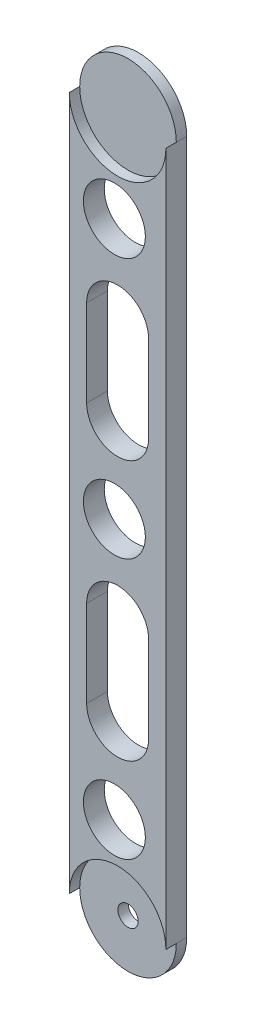
ISO-10303-21;
HEADER;
FILE_DESCRIPTION(('STEP AP214'),'2;1');
FILE_NAME('part.step','',(''),(''),'','','');
FILE_SCHEMA(('AUTOMOTIVE_DESIGN { 1 0 10303 214 1 1 1 1 }'));
ENDSEC;
DATA;
#1=APPLICATION_CONTEXT('core data for automotive mechanical design processes');
#2=APPLICATION_PROTOCOL_DEFINITION('international standard','automotive_design',2000,#1);
#3=PRODUCT_CONTEXT('',#1,'mechanical');
#4=PRODUCT('Part','Part','',(#3));
#5=PRODUCT_RELATED_PRODUCT_CATEGORY('part','',(#4));
#6=PRODUCT_DEFINITION_FORMATION('','',#4);
#7=PRODUCT_DEFINITION_CONTEXT('part definition',#1,'design');
#8=PRODUCT_DEFINITION('design','',#6,#7);
#9=PRODUCT_DEFINITION_SHAPE('','',#8);
#10=(LENGTH_UNIT() NAMED_UNIT(*) SI_UNIT(.MILLI.,.METRE.));
#11=(NAMED_UNIT(*) PLANE_ANGLE_UNIT() SI_UNIT($,.RADIAN.));
#12=(NAMED_UNIT(*) SI_UNIT($,.STERADIAN.) SOLID_ANGLE_UNIT());
#13=UNCERTAINTY_MEASURE_WITH_UNIT(LENGTH_MEASURE(1.E-05),#10,'distance_accuracy_value','');
#14=(GEOMETRIC_REPRESENTATION_CONTEXT(3) GLOBAL_UNCERTAINTY_ASSIGNED_CONTEXT((#13)) GLOBAL_UNIT_ASSIGNED_CONTEXT((#10,
#11,#12)) REPRESENTATION_CONTEXT('',''));
#15=CARTESIAN_POINT('',(0.,0.,0.));
#16=DIRECTION('',(0.,0.,1.));
#17=DIRECTION('',(1.,0.,0.));
#18=AXIS2_PLACEMENT_3D('',#15,#16,#17);
#19=CARTESIAN_POINT('',(0.,0.,6.));
#20=DIRECTION('',(0.,0.,1.));
#21=DIRECTION('',(1.,0.,0.));
#22=AXIS2_PLACEMENT_3D('',#19,#20,#21);
#23=PLANE('',#22);
#24=CARTESIAN_POINT('',(3.04057135861746,-147.813095238095,6.));
#25=DIRECTION('',(0.,0.,1.));
#26=DIRECTION('',(1.,0.,0.));
#27=AXIS2_PLACEMENT_3D('',#24,#25,#26);
#28=CIRCLE('',#27,8.925);
#29=CARTESIAN_POINT('',(11.9655713586175,-147.813095238095,6.));
#30=VERTEX_POINT('',#29);
#31=EDGE_CURVE('E505',#30,#30,#28,.T.);
#32=ORIENTED_EDGE('',*,*,#31,.F.);
#33=EDGE_LOOP('',(#32));
#34=FACE_BOUND('',#33,.T.);
#35=CARTESIAN_POINT('',(3.9664527218137,-122.813095238095,6.));
#36=DIRECTION('',(0.,0.,1.));
#37=DIRECTION('',(1.,0.,0.));
#38=AXIS2_PLACEMENT_3D('',#35,#36,#37);
#39=CIRCLE('',#38,8.925);
#40=CARTESIAN_POINT('',(12.8914527218137,-122.813095238095,6.));
#41=VERTEX_POINT('',#40);
#42=CARTESIAN_POINT('',(-4.9585472781863,-122.813095238095,6.));
#43=VERTEX_POINT('',#42);
#44=EDGE_CURVE('E166',#41,#43,#39,.F.);
#45=ORIENTED_EDGE('',*,*,#44,.T.);
#46=DIRECTION('',(0.,1.,0.));
#47=VECTOR('',#46,1.);
#48=CARTESIAN_POINT('',(-4.95854727818629,0.,6.));
#49=LINE('',#48,#47);
#50=CARTESIAN_POINT('',(-4.9585472781863,-97.8130952380952,6.));
#51=VERTEX_POINT('',#50);
#52=EDGE_CURVE('E169',#43,#51,#49,.T.);
#53=ORIENTED_EDGE('',*,*,#52,.T.);
#54=CARTESIAN_POINT('',(3.9664527218137,-97.8130952380952,6.));
#55=DIRECTION('',(0.,0.,1.));
#56=DIRECTION('',(1.,0.,0.));
#57=AXIS2_PLACEMENT_3D('',#54,#55,#56);
#58=CIRCLE('',#57,8.925);
#59=CARTESIAN_POINT('',(12.8914527218137,-97.8130952380952,6.));
#60=VERTEX_POINT('',#59);
#61=EDGE_CURVE('E161',#51,#60,#58,.F.);
#62=ORIENTED_EDGE('',*,*,#61,.T.);
#63=DIRECTION('',(0.,1.,0.));
#64=VECTOR('',#63,1.);
#65=CARTESIAN_POINT('',(12.8914527218137,0.,6.));
#66=LINE('',#65,#64);
#67=EDGE_CURVE('E141',#41,#60,#66,.T.);
#68=ORIENTED_EDGE('',*,*,#67,.F.);
#69=EDGE_LOOP('',(#45,#53,#62,#68));
#70=FACE_BOUND('',#69,.T.);
#71=CARTESIAN_POINT('',(3.04057135861746,-72.8130952380952,6.));
#72=DIRECTION('',(0.,0.,1.));
#73=DIRECTION('',(1.,0.,0.));
#74=AXIS2_PLACEMENT_3D('',#71,#72,#73);
#75=CIRCLE('',#74,8.925);
#76=CARTESIAN_POINT('',(11.9655713586175,-72.8130952380952,6.));
#77=VERTEX_POINT('',#76);
#78=EDGE_CURVE('E175',#77,#77,#75,.T.);
#79=ORIENTED_EDGE('',*,*,#78,.F.);
#80=EDGE_LOOP('',(#79));
#81=FACE_BOUND('',#80,.T.);
#82=CARTESIAN_POINT('',(3.04057135861746,2.1869047619048,6.));
#83=DIRECTION('',(0.,0.,1.));
#84=DIRECTION('',(1.,0.,0.));
#85=AXIS2_PLACEMENT_3D('',#82,#83,#84);
#86=CIRCLE('',#85,8.925);
#87=CARTESIAN_POINT('',(11.9655713586175,2.1869047619048,6.));
#88=VERTEX_POINT('',#87);
#89=EDGE_CURVE('E213',#88,#88,#86,.T.);
#90=ORIENTED_EDGE('',*,*,#89,.F.);
#91=EDGE_LOOP('',(#90));
#92=FACE_BOUND('',#91,.T.);
#93=CARTESIAN_POINT('',(3.9664527218137,27.1869047619048,6.));
#94=DIRECTION('',(0.,0.,1.));
#95=DIRECTION('',(1.,0.,0.));
#96=AXIS2_PLACEMENT_3D('',#93,#94,#95);
#97=CIRCLE('',#96,13.925);
#98=CARTESIAN_POINT('',(-9.9585472781863,27.1869047619048,6.));
#99=VERTEX_POINT('',#98);
#100=CARTESIAN_POINT('',(17.8914527218137,27.1869047619048,6.));
#101=VERTEX_POINT('',#100);
#102=EDGE_CURVE('E11',#99,#101,#97,.T.);
#103=ORIENTED_EDGE('',*,*,#102,.F.);
#104=DIRECTION('',(0.,-1.,0.));
#105=VECTOR('',#104,1.);
#106=CARTESIAN_POINT('',(-9.95854727818629,0.,6.));
#107=LINE('',#106,#105);
#108=CARTESIAN_POINT('',(-9.95854727818629,-172.813095238095,6.));
#109=VERTEX_POINT('',#108);
#110=EDGE_CURVE('E236',#99,#109,#107,.T.);
#111=ORIENTED_EDGE('',*,*,#110,.T.);
#112=CARTESIAN_POINT('',(3.96645272181372,-172.813095238095,6.));
#113=DIRECTION('',(0.,0.,1.));
#114=DIRECTION('',(1.,0.,0.));
#115=AXIS2_PLACEMENT_3D('',#112,#113,#114);
#116=CIRCLE('',#115,13.925);
#117=CARTESIAN_POINT('',(17.8914527218137,-172.813095238095,6.));
#118=VERTEX_POINT('',#117);
#119=EDGE_CURVE('E224',#118,#109,#116,.T.);
#120=ORIENTED_EDGE('',*,*,#119,.F.);
#121=DIRECTION('',(0.,-1.,0.));
#122=VECTOR('',#121,1.);
#123=CARTESIAN_POINT('',(17.8914527218137,0.,6.));
#124=LINE('',#123,#122);
#125=EDGE_CURVE('E233',#101,#118,#124,.T.);
#126=ORIENTED_EDGE('',*,*,#125,.F.);
#127=EDGE_LOOP('',(#103,#111,#120,#126));
#128=FACE_BOUND('',#127,.T.);
#129=DIRECTION('',(0.,1.,0.));
#130=VECTOR('',#129,1.);
#131=CARTESIAN_POINT('',(-4.95854727818629,0.,6.));
#132=LINE('',#131,#130);
#133=CARTESIAN_POINT('',(-4.9585472781863,-47.8130952380952,6.));
#134=VERTEX_POINT('',#133);
#135=CARTESIAN_POINT('',(-4.9585472781863,-22.8130952380952,6.));
#136=VERTEX_POINT('',#135);
#137=EDGE_CURVE('E204',#134,#136,#132,.T.);
#138=ORIENTED_EDGE('',*,*,#137,.T.);
#139=CARTESIAN_POINT('',(3.9664527218137,-22.8130952380952,6.));
#140=DIRECTION('',(0.,0.,1.));
#141=DIRECTION('',(1.,0.,0.));
#142=AXIS2_PLACEMENT_3D('',#139,#140,#141);
#143=CIRCLE('',#142,8.925);
#144=CARTESIAN_POINT('',(12.8914527218137,-22.8130952380952,6.));
#145=VERTEX_POINT('',#144);
#146=EDGE_CURVE('E207',#136,#145,#143,.F.);
#147=ORIENTED_EDGE('',*,*,#146,.T.);
#148=DIRECTION('',(0.,1.,0.));
#149=VECTOR('',#148,1.);
#150=CARTESIAN_POINT('',(12.8914527218137,0.,6.));
#151=LINE('',#150,#149);
#152=CARTESIAN_POINT('',(12.8914527218137,-47.8130952380952,6.));
#153=VERTEX_POINT('',#152);
#154=EDGE_CURVE('E193',#153,#145,#151,.T.);
#155=ORIENTED_EDGE('',*,*,#154,.F.);
#156=CARTESIAN_POINT('',(3.9664527218137,-47.8130952380952,6.));
#157=DIRECTION('',(0.,0.,1.));
#158=DIRECTION('',(1.,0.,0.));
#159=AXIS2_PLACEMENT_3D('',#156,#157,#158);
#160=CIRCLE('',#159,8.925);
#161=EDGE_CURVE('E201',#153,#134,#160,.F.);
#162=ORIENTED_EDGE('',*,*,#161,.T.);
#163=EDGE_LOOP('',(#138,#147,#155,#162));
#164=FACE_BOUND('',#163,.T.);
#165=ADVANCED_FACE('F35',(#34,#70,#81,#92,#128,#164),#23,.T.);
#166=CARTESIAN_POINT('',(0.,0.,0.));
#167=DIRECTION('',(0.,0.,1.));
#168=DIRECTION('',(1.,0.,0.));
#169=AXIS2_PLACEMENT_3D('',#166,#167,#168);
#170=PLANE('',#169);
#171=CARTESIAN_POINT('',(3.04057135861746,-147.813095238095,0.));
#172=DIRECTION('',(0.,0.,-1.));
#173=DIRECTION('',(-1.,0.,0.));
#174=AXIS2_PLACEMENT_3D('',#171,#172,#173);
#175=CIRCLE('',#174,8.925);
#176=CARTESIAN_POINT('',(-5.88442864138254,-147.813095238095,0.));
#177=VERTEX_POINT('',#176);
#178=EDGE_CURVE('E508',#177,#177,#175,.T.);
#179=ORIENTED_EDGE('',*,*,#178,.F.);
#180=EDGE_LOOP('',(#179));
#181=FACE_BOUND('',#180,.T.);
#182=DIRECTION('',(0.,-1.,0.));
#183=VECTOR('',#182,1.);
#184=CARTESIAN_POINT('',(-4.95854727818629,0.,0.));
#185=LINE('',#184,#183);
#186=CARTESIAN_POINT('',(-4.9585472781863,-97.8130952380952,0.));
#187=VERTEX_POINT('',#186);
#188=CARTESIAN_POINT('',(-4.9585472781863,-122.813095238095,0.));
#189=VERTEX_POINT('',#188);
#190=EDGE_CURVE('E58',#187,#189,#185,.T.);
#191=ORIENTED_EDGE('',*,*,#190,.T.);
#192=CARTESIAN_POINT('',(3.9664527218137,-122.813095238095,0.));
#193=DIRECTION('',(0.,0.,-1.));
#194=DIRECTION('',(-1.,0.,0.));
#195=AXIS2_PLACEMENT_3D('',#192,#193,#194);
#196=CIRCLE('',#195,8.925);
#197=CARTESIAN_POINT('',(12.8914527218137,-122.813095238095,0.));
#198=VERTEX_POINT('',#197);
#199=EDGE_CURVE('E154',#189,#198,#196,.F.);
#200=ORIENTED_EDGE('',*,*,#199,.T.);
#201=DIRECTION('',(0.,-1.,0.));
#202=VECTOR('',#201,1.);
#203=CARTESIAN_POINT('',(12.8914527218137,0.,0.));
#204=LINE('',#203,#202);
#205=CARTESIAN_POINT('',(12.8914527218137,-97.8130952380952,0.));
#206=VERTEX_POINT('',#205);
#207=EDGE_CURVE('E138',#206,#198,#204,.T.);
#208=ORIENTED_EDGE('',*,*,#207,.F.);
#209=CARTESIAN_POINT('',(3.9664527218137,-97.8130952380952,0.));
#210=DIRECTION('',(0.,0.,-1.));
#211=DIRECTION('',(-1.,0.,0.));
#212=AXIS2_PLACEMENT_3D('',#209,#210,#211);
#213=CIRCLE('',#212,8.925);
#214=EDGE_CURVE('E147',#206,#187,#213,.F.);
#215=ORIENTED_EDGE('',*,*,#214,.T.);
#216=EDGE_LOOP('',(#191,#200,#208,#215));
#217=FACE_BOUND('',#216,.T.);
#218=CARTESIAN_POINT('',(3.04057135861746,-72.8130952380952,0.));
#219=DIRECTION('',(0.,0.,-1.));
#220=DIRECTION('',(-1.,0.,0.));
#221=AXIS2_PLACEMENT_3D('',#218,#219,#220);
#222=CIRCLE('',#221,8.925);
#223=CARTESIAN_POINT('',(-5.88442864138254,-72.8130952380952,0.));
#224=VERTEX_POINT('',#223);
#225=EDGE_CURVE('E172',#224,#224,#222,.T.);
#226=ORIENTED_EDGE('',*,*,#225,.F.);
#227=EDGE_LOOP('',(#226));
#228=FACE_BOUND('',#227,.T.);
#229=DIRECTION('',(0.,-1.,0.));
#230=VECTOR('',#229,1.);
#231=CARTESIAN_POINT('',(17.8914527218137,0.,0.));
#232=LINE('',#231,#230);
#233=CARTESIAN_POINT('',(17.8914527218137,27.1869047619048,0.));
#234=VERTEX_POINT('',#233);
#235=CARTESIAN_POINT('',(17.8914527218137,-172.813095238095,0.));
#236=VERTEX_POINT('',#235);
#237=EDGE_CURVE('E230',#234,#236,#232,.T.);
#238=ORIENTED_EDGE('',*,*,#237,.T.);
#239=CARTESIAN_POINT('',(3.96645272181372,-172.813095238095,0.));
#240=DIRECTION('',(0.,0.,1.));
#241=DIRECTION('',(1.,0.,0.));
#242=AXIS2_PLACEMENT_3D('',#239,#240,#241);
#243=CIRCLE('',#242,13.925);
#244=CARTESIAN_POINT('',(-9.95854727818627,-172.813095238095,0.));
#245=VERTEX_POINT('',#244);
#246=EDGE_CURVE('E237',#245,#236,#243,.T.);
#247=ORIENTED_EDGE('',*,*,#246,.F.);
#248=DIRECTION('',(0.,-1.,0.));
#249=VECTOR('',#248,1.);
#250=CARTESIAN_POINT('',(-9.95854727818629,0.,0.));
#251=LINE('',#250,#249);
#252=CARTESIAN_POINT('',(-9.9585472781863,27.1869047619048,0.));
#253=VERTEX_POINT('',#252);
#254=EDGE_CURVE('E246',#253,#245,#251,.T.);
#255=ORIENTED_EDGE('',*,*,#254,.F.);
#256=CARTESIAN_POINT('',(3.9664527218137,27.1869047619048,0.));
#257=DIRECTION('',(0.,0.,1.));
#258=DIRECTION('',(1.,0.,0.));
#259=AXIS2_PLACEMENT_3D('',#256,#257,#258);
#260=CIRCLE('',#259,13.925);
#261=EDGE_CURVE('E243',#234,#253,#260,.T.);
#262=ORIENTED_EDGE('',*,*,#261,.F.);
#263=EDGE_LOOP('',(#238,#247,#255,#262));
#264=FACE_BOUND('',#263,.T.);
#265=CARTESIAN_POINT('',(3.96645272181372,-172.813095238095,0.));
#266=DIRECTION('',(0.,0.,1.));
#267=DIRECTION('',(1.,0.,0.));
#268=AXIS2_PLACEMENT_3D('',#265,#266,#267);
#269=CIRCLE('',#268,2.925);
#270=CARTESIAN_POINT('',(6.89145272181372,-172.813095238095,0.));
#271=VERTEX_POINT('',#270);
#272=EDGE_CURVE('E221',#271,#271,#269,.T.);
#273=ORIENTED_EDGE('',*,*,#272,.T.);
#274=EDGE_LOOP('',(#273));
#275=FACE_BOUND('',#274,.T.);
#276=CARTESIAN_POINT('',(3.04057135861746,2.1869047619048,0.));
#277=DIRECTION('',(0.,0.,-1.));
#278=DIRECTION('',(-1.,0.,0.));
#279=AXIS2_PLACEMENT_3D('',#276,#277,#278);
#280=CIRCLE('',#279,8.925);
#281=CARTESIAN_POINT('',(-5.88442864138254,2.1869047619048,0.));
#282=VERTEX_POINT('',#281);
#283=EDGE_CURVE('E210',#282,#282,#280,.T.);
#284=ORIENTED_EDGE('',*,*,#283,.F.);
#285=EDGE_LOOP('',(#284));
#286=FACE_BOUND('',#285,.T.);
#287=CARTESIAN_POINT('',(3.9664527218137,-22.8130952380952,0.));
#288=DIRECTION('',(0.,0.,-1.));
#289=DIRECTION('',(-1.,0.,0.));
#290=AXIS2_PLACEMENT_3D('',#287,#288,#289);
#291=CIRCLE('',#290,8.925);
#292=CARTESIAN_POINT('',(12.8914527218137,-22.8130952380952,0.));
#293=VERTEX_POINT('',#292);
#294=CARTESIAN_POINT('',(-4.9585472781863,-22.8130952380952,0.));
#295=VERTEX_POINT('',#294);
#296=EDGE_CURVE('E178',#293,#295,#291,.F.);
#297=ORIENTED_EDGE('',*,*,#296,.T.);
#298=DIRECTION('',(0.,-1.,0.));
#299=VECTOR('',#298,1.);
#300=CARTESIAN_POINT('',(-4.95854727818629,0.,0.));
#301=LINE('',#300,#299);
#302=CARTESIAN_POINT('',(-4.9585472781863,-47.8130952380952,0.));
#303=VERTEX_POINT('',#302);
#304=EDGE_CURVE('E187',#295,#303,#301,.T.);
#305=ORIENTED_EDGE('',*,*,#304,.T.);
#306=CARTESIAN_POINT('',(3.9664527218137,-47.8130952380952,0.));
#307=DIRECTION('',(0.,0.,-1.));
#308=DIRECTION('',(-1.,0.,0.));
#309=AXIS2_PLACEMENT_3D('',#306,#307,#308);
#310=CIRCLE('',#309,8.925);
#311=CARTESIAN_POINT('',(12.8914527218137,-47.8130952380952,0.));
#312=VERTEX_POINT('',#311);
#313=EDGE_CURVE('E184',#303,#312,#310,.F.);
#314=ORIENTED_EDGE('',*,*,#313,.T.);
#315=DIRECTION('',(0.,-1.,0.));
#316=VECTOR('',#315,1.);
#317=CARTESIAN_POINT('',(12.8914527218137,0.,0.));
#318=LINE('',#317,#316);
#319=EDGE_CURVE('E181',#293,#312,#318,.T.);
#320=ORIENTED_EDGE('',*,*,#319,.F.);
#321=EDGE_LOOP('',(#297,#305,#314,#320));
#322=FACE_BOUND('',#321,.T.);
#323=ADVANCED_FACE('F151',(#181,#217,#228,#264,#275,#286,#322),#170,.F.);
#324=CARTESIAN_POINT('',(3.9664527218137,27.1869047619048,6.));
#325=DIRECTION('',(0.,0.,-1.));
#326=DIRECTION('',(-1.,0.,0.));
#327=AXIS2_PLACEMENT_3D('',#324,#325,#326);
#328=CYLINDRICAL_SURFACE('',#327,13.925);
#329=CARTESIAN_POINT('',(3.9664527218137,27.1869047619048,3.));
#330=DIRECTION('',(0.,0.,1.));
#331=DIRECTION('',(1.,0.,0.));
#332=AXIS2_PLACEMENT_3D('',#329,#330,#331);
#333=CIRCLE('',#332,13.925);
#334=CARTESIAN_POINT('',(17.8914527218137,27.1869047619048,3.));
#335=VERTEX_POINT('',#334);
#336=CARTESIAN_POINT('',(-9.9585472781863,27.1869047619048,3.));
#337=VERTEX_POINT('',#336);
#338=EDGE_CURVE('E217',#335,#337,#333,.T.);
#339=ORIENTED_EDGE('',*,*,#338,.F.);
#340=DIRECTION('',(0.,0.,-1.));
#341=VECTOR('',#340,1.);
#342=CARTESIAN_POINT('',(17.8914527218137,27.1869047619048,6.));
#343=LINE('',#342,#341);
#344=EDGE_CURVE('E260',#335,#234,#343,.T.);
#345=ORIENTED_EDGE('',*,*,#344,.T.);
#346=ORIENTED_EDGE('',*,*,#261,.T.);
#347=DIRECTION('',(0.,0.,-1.));
#348=VECTOR('',#347,1.);
#349=CARTESIAN_POINT('',(-9.9585472781863,27.1869047619048,6.));
#350=LINE('',#349,#348);
#351=EDGE_CURVE('E257',#337,#253,#350,.T.);
#352=ORIENTED_EDGE('',*,*,#351,.F.);
#353=EDGE_LOOP('',(#339,#345,#346,#352));
#354=FACE_BOUND('',#353,.T.);
#355=ADVANCED_FACE('F268',(#354),#328,.T.);
#356=CARTESIAN_POINT('',(3.96645272181372,-172.813095238095,6.));
#357=DIRECTION('',(0.,0.,-1.));
#358=DIRECTION('',(-1.,0.,0.));
#359=AXIS2_PLACEMENT_3D('',#356,#357,#358);
#360=CYLINDRICAL_SURFACE('',#359,13.925);
#361=CARTESIAN_POINT('',(3.96645272181372,-172.813095238095,3.));
#362=DIRECTION('',(0.,0.,1.));
#363=DIRECTION('',(1.,0.,0.));
#364=AXIS2_PLACEMENT_3D('',#361,#362,#363);
#365=CIRCLE('',#364,13.925);
#366=CARTESIAN_POINT('',(-9.95854727818629,-172.813095238095,3.));
#367=VERTEX_POINT('',#366);
#368=CARTESIAN_POINT('',(17.8914527218137,-172.813095238095,3.));
#369=VERTEX_POINT('',#368);
#370=EDGE_CURVE('E231',#367,#369,#365,.T.);
#371=ORIENTED_EDGE('',*,*,#370,.F.);
#372=DIRECTION('',(0.,0.,-1.));
#373=VECTOR('',#372,1.);
#374=CARTESIAN_POINT('',(-9.95854727818627,-172.813095238095,6.));
#375=LINE('',#374,#373);
#376=EDGE_CURVE('E254',#367,#245,#375,.T.);
#377=ORIENTED_EDGE('',*,*,#376,.T.);
#378=ORIENTED_EDGE('',*,*,#246,.T.);
#379=DIRECTION('',(0.,0.,-1.));
#380=VECTOR('',#379,1.);
#381=CARTESIAN_POINT('',(17.8914527218137,-172.813095238095,6.));
#382=LINE('',#381,#380);
#383=EDGE_CURVE('E240',#369,#236,#382,.T.);
#384=ORIENTED_EDGE('',*,*,#383,.F.);
#385=EDGE_LOOP('',(#371,#377,#378,#384));
#386=FACE_BOUND('',#385,.T.);
#387=ADVANCED_FACE('F279',(#386),#360,.T.);
#388=CARTESIAN_POINT('',(17.8914527218137,0.,6.));
#389=DIRECTION('',(1.,0.,0.));
#390=DIRECTION('',(0.,1.,0.));
#391=AXIS2_PLACEMENT_3D('',#388,#389,#390);
#392=PLANE('',#391);
#393=ORIENTED_EDGE('',*,*,#237,.F.);
#394=ORIENTED_EDGE('',*,*,#344,.F.);
#395=EDGE_CURVE('E43',#101,#335,#343,.T.);
#396=ORIENTED_EDGE('',*,*,#395,.F.);
#397=ORIENTED_EDGE('',*,*,#125,.T.);
#398=EDGE_CURVE('E251',#118,#369,#382,.T.);
#399=ORIENTED_EDGE('',*,*,#398,.T.);
#400=ORIENTED_EDGE('',*,*,#383,.T.);
#401=EDGE_LOOP('',(#393,#394,#396,#397,#399,#400));
#402=FACE_BOUND('',#401,.T.);
#403=ADVANCED_FACE('F37',(#402),#392,.T.);
#404=CARTESIAN_POINT('',(-9.95854727818629,0.,6.));
#405=DIRECTION('',(1.,0.,0.));
#406=DIRECTION('',(0.,1.,0.));
#407=AXIS2_PLACEMENT_3D('',#404,#405,#406);
#408=PLANE('',#407);
#409=ORIENTED_EDGE('',*,*,#254,.T.);
#410=ORIENTED_EDGE('',*,*,#376,.F.);
#411=EDGE_CURVE('E255',#109,#367,#375,.T.);
#412=ORIENTED_EDGE('',*,*,#411,.F.);
#413=ORIENTED_EDGE('',*,*,#110,.F.);
#414=EDGE_CURVE('E258',#99,#337,#350,.T.);
#415=ORIENTED_EDGE('',*,*,#414,.T.);
#416=ORIENTED_EDGE('',*,*,#351,.T.);
#417=EDGE_LOOP('',(#409,#410,#412,#413,#415,#416));
#418=FACE_BOUND('',#417,.T.);
#419=ADVANCED_FACE('F283',(#418),#408,.F.);
#420=CARTESIAN_POINT('',(3.96645272181372,-172.813095238095,3.));
#421=DIRECTION('',(0.,0.,1.));
#422=DIRECTION('',(1.,0.,0.));
#423=AXIS2_PLACEMENT_3D('',#420,#421,#422);
#424=CYLINDRICAL_SURFACE('',#423,13.925);
#425=ORIENTED_EDGE('',*,*,#398,.F.);
#426=ORIENTED_EDGE('',*,*,#119,.T.);
#427=ORIENTED_EDGE('',*,*,#411,.T.);
#428=EDGE_CURVE('E227',#369,#367,#365,.T.);
#429=ORIENTED_EDGE('',*,*,#428,.F.);
#430=EDGE_LOOP('',(#425,#426,#427,#429));
#431=FACE_BOUND('',#430,.T.);
#432=ADVANCED_FACE('F292',(#431),#424,.F.);
#433=CARTESIAN_POINT('',(3.96645272181372,-172.813095238095,3.));
#434=DIRECTION('',(0.,0.,1.));
#435=DIRECTION('',(1.,0.,0.));
#436=AXIS2_PLACEMENT_3D('',#433,#434,#435);
#437=PLANE('',#436);
#438=CARTESIAN_POINT('',(3.96645272181372,-172.813095238095,3.));
#439=DIRECTION('',(0.,0.,1.));
#440=DIRECTION('',(1.,0.,0.));
#441=AXIS2_PLACEMENT_3D('',#438,#439,#440);
#442=CIRCLE('',#441,2.925);
#443=CARTESIAN_POINT('',(6.89145272181372,-172.813095238095,3.));
#444=VERTEX_POINT('',#443);
#445=EDGE_CURVE('E220',#444,#444,#442,.T.);
#446=ORIENTED_EDGE('',*,*,#445,.F.);
#447=EDGE_LOOP('',(#446));
#448=FACE_BOUND('',#447,.T.);
#449=ORIENTED_EDGE('',*,*,#428,.T.);
#450=ORIENTED_EDGE('',*,*,#370,.T.);
#451=EDGE_LOOP('',(#449,#450));
#452=FACE_BOUND('',#451,.T.);
#453=ADVANCED_FACE('F295',(#448,#452),#437,.T.);
#454=CARTESIAN_POINT('',(3.96645272181372,-172.813095238095,0.));
#455=DIRECTION('',(0.,0.,1.));
#456=DIRECTION('',(1.,0.,0.));
#457=AXIS2_PLACEMENT_3D('',#454,#455,#456);
#458=CYLINDRICAL_SURFACE('',#457,2.925);
#459=ORIENTED_EDGE('',*,*,#272,.F.);
#460=EDGE_LOOP('',(#459));
#461=FACE_BOUND('',#460,.T.);
#462=ORIENTED_EDGE('',*,*,#445,.T.);
#463=EDGE_LOOP('',(#462));
#464=FACE_BOUND('',#463,.T.);
#465=ADVANCED_FACE('F297',(#461,#464),#458,.F.);
#466=CARTESIAN_POINT('',(3.9664527218137,27.1869047619048,3.));
#467=DIRECTION('',(0.,0.,1.));
#468=DIRECTION('',(1.,0.,0.));
#469=AXIS2_PLACEMENT_3D('',#466,#467,#468);
#470=CYLINDRICAL_SURFACE('',#469,13.925);
#471=EDGE_CURVE('E216',#337,#335,#333,.T.);
#472=ORIENTED_EDGE('',*,*,#471,.F.);
#473=ORIENTED_EDGE('',*,*,#414,.F.);
#474=ORIENTED_EDGE('',*,*,#102,.T.);
#475=ORIENTED_EDGE('',*,*,#395,.T.);
#476=EDGE_LOOP('',(#472,#473,#474,#475));
#477=FACE_BOUND('',#476,.T.);
#478=ADVANCED_FACE('F286',(#477),#470,.F.);
#479=CARTESIAN_POINT('',(3.9664527218137,27.1869047619048,3.));
#480=DIRECTION('',(0.,0.,1.));
#481=DIRECTION('',(1.,0.,0.));
#482=AXIS2_PLACEMENT_3D('',#479,#480,#481);
#483=PLANE('',#482);
#484=ORIENTED_EDGE('',*,*,#338,.T.);
#485=ORIENTED_EDGE('',*,*,#471,.T.);
#486=EDGE_LOOP('',(#484,#485));
#487=FACE_BOUND('',#486,.T.);
#488=ADVANCED_FACE('F362',(#487),#483,.T.);
#489=CARTESIAN_POINT('',(3.04057135861746,2.1869047619048,10.));
#490=DIRECTION('',(0.,0.,-1.));
#491=DIRECTION('',(-1.,0.,0.));
#492=AXIS2_PLACEMENT_3D('',#489,#490,#491);
#493=CYLINDRICAL_SURFACE('',#492,8.925);
#494=ORIENTED_EDGE('',*,*,#89,.T.);
#495=EDGE_LOOP('',(#494));
#496=FACE_BOUND('',#495,.T.);
#497=ORIENTED_EDGE('',*,*,#283,.T.);
#498=EDGE_LOOP('',(#497));
#499=FACE_BOUND('',#498,.T.);
#500=ADVANCED_FACE('F369',(#496,#499),#493,.F.);
#501=CARTESIAN_POINT('',(3.9664527218137,-22.8130952380952,10.));
#502=DIRECTION('',(0.,0.,-1.));
#503=DIRECTION('',(-1.,0.,0.));
#504=AXIS2_PLACEMENT_3D('',#501,#502,#503);
#505=CYLINDRICAL_SURFACE('',#504,8.925);
#506=DIRECTION('',(0.,0.,-1.));
#507=VECTOR('',#506,1.);
#508=CARTESIAN_POINT('',(-4.9585472781863,-22.8130952380952,10.));
#509=LINE('',#508,#507);
#510=EDGE_CURVE('E191',#136,#295,#509,.T.);
#511=ORIENTED_EDGE('',*,*,#510,.T.);
#512=ORIENTED_EDGE('',*,*,#296,.F.);
#513=DIRECTION('',(0.,0.,-1.));
#514=VECTOR('',#513,1.);
#515=CARTESIAN_POINT('',(12.8914527218137,-22.8130952380952,10.));
#516=LINE('',#515,#514);
#517=EDGE_CURVE('E190',#145,#293,#516,.T.);
#518=ORIENTED_EDGE('',*,*,#517,.F.);
#519=ORIENTED_EDGE('',*,*,#146,.F.);
#520=EDGE_LOOP('',(#511,#512,#518,#519));
#521=FACE_BOUND('',#520,.T.);
#522=ADVANCED_FACE('F377',(#521),#505,.F.);
#523=CARTESIAN_POINT('',(-4.95854727818629,0.,10.));
#524=DIRECTION('',(1.,0.,0.));
#525=DIRECTION('',(0.,1.,0.));
#526=AXIS2_PLACEMENT_3D('',#523,#524,#525);
#527=PLANE('',#526);
#528=DIRECTION('',(0.,0.,-1.));
#529=VECTOR('',#528,1.);
#530=CARTESIAN_POINT('',(-4.9585472781863,-47.8130952380952,10.));
#531=LINE('',#530,#529);
#532=EDGE_CURVE('E194',#134,#303,#531,.T.);
#533=ORIENTED_EDGE('',*,*,#532,.T.);
#534=ORIENTED_EDGE('',*,*,#304,.F.);
#535=ORIENTED_EDGE('',*,*,#510,.F.);
#536=ORIENTED_EDGE('',*,*,#137,.F.);
#537=EDGE_LOOP('',(#533,#534,#535,#536));
#538=FACE_BOUND('',#537,.T.);
#539=ADVANCED_FACE('F385',(#538),#527,.T.);
#540=CARTESIAN_POINT('',(3.9664527218137,-47.8130952380952,10.));
#541=DIRECTION('',(0.,0.,-1.));
#542=DIRECTION('',(-1.,0.,0.));
#543=AXIS2_PLACEMENT_3D('',#540,#541,#542);
#544=CYLINDRICAL_SURFACE('',#543,8.925);
#545=DIRECTION('',(0.,0.,-1.));
#546=VECTOR('',#545,1.);
#547=CARTESIAN_POINT('',(12.8914527218137,-47.8130952380952,10.));
#548=LINE('',#547,#546);
#549=EDGE_CURVE('E196',#153,#312,#548,.T.);
#550=ORIENTED_EDGE('',*,*,#549,.T.);
#551=ORIENTED_EDGE('',*,*,#313,.F.);
#552=ORIENTED_EDGE('',*,*,#532,.F.);
#553=ORIENTED_EDGE('',*,*,#161,.F.);
#554=EDGE_LOOP('',(#550,#551,#552,#553));
#555=FACE_BOUND('',#554,.T.);
#556=ADVANCED_FACE('F393',(#555),#544,.F.);
#557=CARTESIAN_POINT('',(12.8914527218137,0.,10.));
#558=DIRECTION('',(1.,0.,0.));
#559=DIRECTION('',(0.,1.,0.));
#560=AXIS2_PLACEMENT_3D('',#557,#558,#559);
#561=PLANE('',#560);
#562=ORIENTED_EDGE('',*,*,#154,.T.);
#563=ORIENTED_EDGE('',*,*,#517,.T.);
#564=ORIENTED_EDGE('',*,*,#319,.T.);
#565=ORIENTED_EDGE('',*,*,#549,.F.);
#566=EDGE_LOOP('',(#562,#563,#564,#565));
#567=FACE_BOUND('',#566,.T.);
#568=ADVANCED_FACE('F401',(#567),#561,.F.);
#569=CARTESIAN_POINT('',(3.04057135861746,-72.8130952380952,10.));
#570=DIRECTION('',(0.,0.,-1.));
#571=DIRECTION('',(-1.,0.,0.));
#572=AXIS2_PLACEMENT_3D('',#569,#570,#571);
#573=CYLINDRICAL_SURFACE('',#572,8.925);
#574=ORIENTED_EDGE('',*,*,#78,.T.);
#575=EDGE_LOOP('',(#574));
#576=FACE_BOUND('',#575,.T.);
#577=ORIENTED_EDGE('',*,*,#225,.T.);
#578=EDGE_LOOP('',(#577));
#579=FACE_BOUND('',#578,.T.);
#580=ADVANCED_FACE('F409',(#576,#579),#573,.F.);
#581=CARTESIAN_POINT('',(-4.95854727818629,0.,10.));
#582=DIRECTION('',(1.,0.,0.));
#583=DIRECTION('',(0.,1.,0.));
#584=AXIS2_PLACEMENT_3D('',#581,#582,#583);
#585=PLANE('',#584);
#586=DIRECTION('',(0.,0.,-1.));
#587=VECTOR('',#586,1.);
#588=CARTESIAN_POINT('',(-4.9585472781863,-122.813095238095,10.));
#589=LINE('',#588,#587);
#590=EDGE_CURVE('E159',#43,#189,#589,.T.);
#591=ORIENTED_EDGE('',*,*,#590,.T.);
#592=ORIENTED_EDGE('',*,*,#190,.F.);
#593=DIRECTION('',(0.,0.,-1.));
#594=VECTOR('',#593,1.);
#595=CARTESIAN_POINT('',(-4.9585472781863,-97.8130952380952,10.));
#596=LINE('',#595,#594);
#597=EDGE_CURVE('E144',#51,#187,#596,.T.);
#598=ORIENTED_EDGE('',*,*,#597,.F.);
#599=ORIENTED_EDGE('',*,*,#52,.F.);
#600=EDGE_LOOP('',(#591,#592,#598,#599));
#601=FACE_BOUND('',#600,.T.);
#602=ADVANCED_FACE('F417',(#601),#585,.T.);
#603=CARTESIAN_POINT('',(3.9664527218137,-122.813095238095,10.));
#604=DIRECTION('',(0.,0.,-1.));
#605=DIRECTION('',(-1.,0.,0.));
#606=AXIS2_PLACEMENT_3D('',#603,#604,#605);
#607=CYLINDRICAL_SURFACE('',#606,8.925);
#608=DIRECTION('',(0.,0.,-1.));
#609=VECTOR('',#608,1.);
#610=CARTESIAN_POINT('',(12.8914527218137,-122.813095238095,10.));
#611=LINE('',#610,#609);
#612=EDGE_CURVE('E143',#41,#198,#611,.T.);
#613=ORIENTED_EDGE('',*,*,#612,.T.);
#614=ORIENTED_EDGE('',*,*,#199,.F.);
#615=ORIENTED_EDGE('',*,*,#590,.F.);
#616=ORIENTED_EDGE('',*,*,#44,.F.);
#617=EDGE_LOOP('',(#613,#614,#615,#616));
#618=FACE_BOUND('',#617,.T.);
#619=ADVANCED_FACE('F425',(#618),#607,.F.);
#620=CARTESIAN_POINT('',(12.8914527218137,0.,10.));
#621=DIRECTION('',(1.,0.,0.));
#622=DIRECTION('',(0.,1.,0.));
#623=AXIS2_PLACEMENT_3D('',#620,#621,#622);
#624=PLANE('',#623);
#625=ORIENTED_EDGE('',*,*,#67,.T.);
#626=DIRECTION('',(0.,0.,-1.));
#627=VECTOR('',#626,1.);
#628=CARTESIAN_POINT('',(12.8914527218137,-97.8130952380952,10.));
#629=LINE('',#628,#627);
#630=EDGE_CURVE('E50',#60,#206,#629,.T.);
#631=ORIENTED_EDGE('',*,*,#630,.T.);
#632=ORIENTED_EDGE('',*,*,#207,.T.);
#633=ORIENTED_EDGE('',*,*,#612,.F.);
#634=EDGE_LOOP('',(#625,#631,#632,#633));
#635=FACE_BOUND('',#634,.T.);
#636=ADVANCED_FACE('F135',(#635),#624,.F.);
#637=CARTESIAN_POINT('',(3.9664527218137,-97.8130952380952,10.));
#638=DIRECTION('',(0.,0.,-1.));
#639=DIRECTION('',(-1.,0.,0.));
#640=AXIS2_PLACEMENT_3D('',#637,#638,#639);
#641=CYLINDRICAL_SURFACE('',#640,8.925);
#642=ORIENTED_EDGE('',*,*,#597,.T.);
#643=ORIENTED_EDGE('',*,*,#214,.F.);
#644=ORIENTED_EDGE('',*,*,#630,.F.);
#645=ORIENTED_EDGE('',*,*,#61,.F.);
#646=EDGE_LOOP('',(#642,#643,#644,#645));
#647=FACE_BOUND('',#646,.T.);
#648=ADVANCED_FACE('F148',(#647),#641,.F.);
#649=CARTESIAN_POINT('',(3.04057135861746,-147.813095238095,10.));
#650=DIRECTION('',(0.,0.,-1.));
#651=DIRECTION('',(-1.,0.,0.));
#652=AXIS2_PLACEMENT_3D('',#649,#650,#651);
#653=CYLINDRICAL_SURFACE('',#652,8.925);
#654=ORIENTED_EDGE('',*,*,#31,.T.);
#655=EDGE_LOOP('',(#654));
#656=FACE_BOUND('',#655,.T.);
#657=ORIENTED_EDGE('',*,*,#178,.T.);
#658=EDGE_LOOP('',(#657));
#659=FACE_BOUND('',#658,.T.);
#660=ADVANCED_FACE('F445',(#656,#659),#653,.F.);
#661=CLOSED_SHELL('',(#165,#323,#355,#387,#403,#419,#432,#453,#465,#478,#488,#500,#522,#539,
#556,#568,#580,#602,#619,#636,#648,#660));
#662=MANIFOLD_SOLID_BREP('B2',#661);
#663=ADVANCED_BREP_SHAPE_REPRESENTATION('',(#18,#662),#14);
#664=SHAPE_DEFINITION_REPRESENTATION(#9,#663);
ENDSEC;
END-ISO-10303-21;
